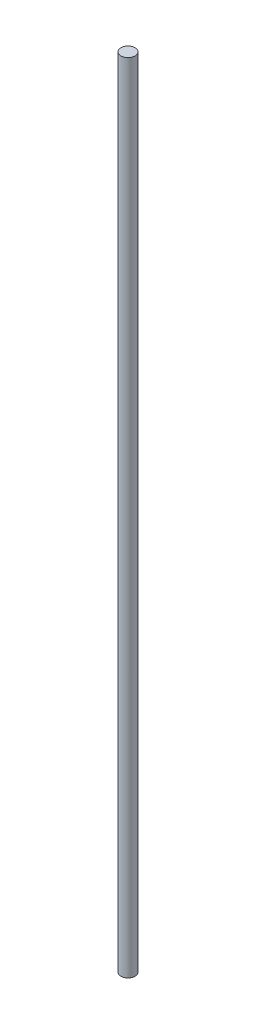
ISO-10303-21;
HEADER;
FILE_DESCRIPTION(('STEP AP214'),'2;1');
FILE_NAME('part.step','',(''),(''),'','','');
FILE_SCHEMA(('AUTOMOTIVE_DESIGN { 1 0 10303 214 1 1 1 1 }'));
ENDSEC;
DATA;
#1=APPLICATION_CONTEXT('core data for automotive mechanical design processes');
#2=APPLICATION_PROTOCOL_DEFINITION('international standard','automotive_design',2000,#1);
#3=PRODUCT_CONTEXT('',#1,'mechanical');
#4=PRODUCT('Part','Part','',(#3));
#5=PRODUCT_RELATED_PRODUCT_CATEGORY('part','',(#4));
#6=PRODUCT_DEFINITION_FORMATION('','',#4);
#7=PRODUCT_DEFINITION_CONTEXT('part definition',#1,'design');
#8=PRODUCT_DEFINITION('design','',#6,#7);
#9=PRODUCT_DEFINITION_SHAPE('','',#8);
#10=(LENGTH_UNIT() NAMED_UNIT(*) SI_UNIT(.MILLI.,.METRE.));
#11=(NAMED_UNIT(*) PLANE_ANGLE_UNIT() SI_UNIT($,.RADIAN.));
#12=(NAMED_UNIT(*) SI_UNIT($,.STERADIAN.) SOLID_ANGLE_UNIT());
#13=UNCERTAINTY_MEASURE_WITH_UNIT(LENGTH_MEASURE(1.E-05),#10,'distance_accuracy_value','');
#14=(GEOMETRIC_REPRESENTATION_CONTEXT(3) GLOBAL_UNCERTAINTY_ASSIGNED_CONTEXT((#13)) GLOBAL_UNIT_ASSIGNED_CONTEXT((#10,
#11,#12)) REPRESENTATION_CONTEXT('',''));
#15=CARTESIAN_POINT('',(0.,0.,0.));
#16=DIRECTION('',(0.,0.,1.));
#17=DIRECTION('',(1.,0.,0.));
#18=AXIS2_PLACEMENT_3D('',#15,#16,#17);
#19=CARTESIAN_POINT('',(0.,177.8,0.));
#20=DIRECTION('',(0.,-1.,0.));
#21=DIRECTION('',(0.,0.,-1.));
#22=AXIS2_PLACEMENT_3D('',#19,#20,#21);
#23=CYLINDRICAL_SURFACE('',#22,1.524);
#24=CARTESIAN_POINT('',(0.,171.061469537297,0.));
#25=DIRECTION('',(0.,-1.,0.));
#26=DIRECTION('',(0.,0.,-1.));
#27=AXIS2_PLACEMENT_3D('',#24,#25,#26);
#28=CIRCLE('',#27,1.524);
#29=CARTESIAN_POINT('',(0.,171.061469537297,-1.524));
#30=VERTEX_POINT('',#29);
#31=EDGE_CURVE('E10',#30,#30,#28,.T.);
#32=ORIENTED_EDGE('',*,*,#31,.T.);
#33=EDGE_LOOP('',(#32));
#34=FACE_BOUND('',#33,.T.);
#35=CARTESIAN_POINT('',(0.,0.,0.));
#36=DIRECTION('',(0.,1.,0.));
#37=DIRECTION('',(0.,0.,1.));
#38=AXIS2_PLACEMENT_3D('',#35,#36,#37);
#39=CIRCLE('',#38,1.524);
#40=CARTESIAN_POINT('',(0.,0.,1.524));
#41=VERTEX_POINT('',#40);
#42=EDGE_CURVE('E37',#41,#41,#39,.T.);
#43=ORIENTED_EDGE('',*,*,#42,.T.);
#44=EDGE_LOOP('',(#43));
#45=FACE_BOUND('',#44,.T.);
#46=ADVANCED_FACE('F31',(#34,#45),#23,.T.);
#47=CARTESIAN_POINT('',(0.,0.,0.));
#48=DIRECTION('',(0.,1.,0.));
#49=DIRECTION('',(0.,0.,1.));
#50=AXIS2_PLACEMENT_3D('',#47,#48,#49);
#51=PLANE('',#50);
#52=ORIENTED_EDGE('',*,*,#42,.F.);
#53=EDGE_LOOP('',(#52));
#54=FACE_BOUND('',#53,.T.);
#55=ADVANCED_FACE('F44',(#54),#51,.F.);
#56=CARTESIAN_POINT('',(-7.62,171.061469537297,1.524));
#57=DIRECTION('',(0.,-1.,0.));
#58=DIRECTION('',(0.,0.,-1.));
#59=AXIS2_PLACEMENT_3D('',#56,#57,#58);
#60=PLANE('',#59);
#61=ORIENTED_EDGE('',*,*,#31,.F.);
#62=EDGE_LOOP('',(#61));
#63=FACE_BOUND('',#62,.T.);
#64=ADVANCED_FACE('F46',(#63),#60,.F.);
#65=CLOSED_SHELL('',(#46,#55,#64));
#66=MANIFOLD_SOLID_BREP('B2',#65);
#67=ADVANCED_BREP_SHAPE_REPRESENTATION('',(#18,#66),#14);
#68=SHAPE_DEFINITION_REPRESENTATION(#9,#67);
ENDSEC;
END-ISO-10303-21;
